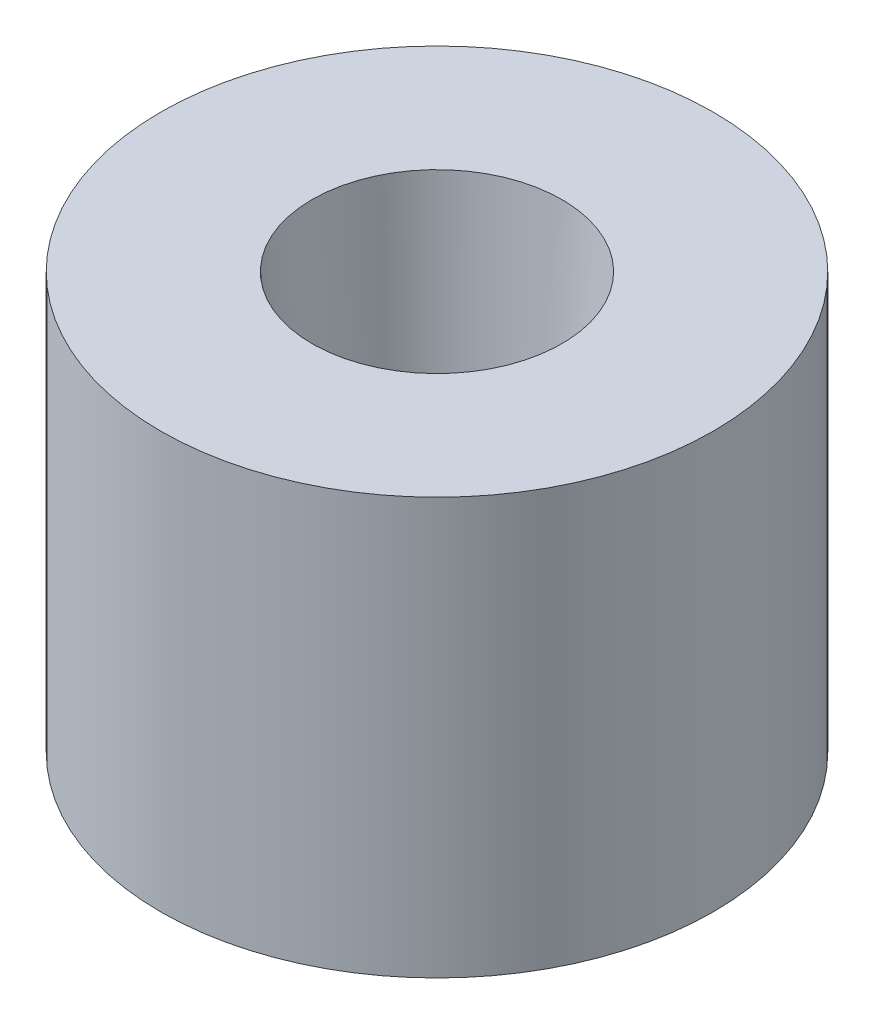
ISO-10303-21;
HEADER;
FILE_DESCRIPTION(('STEP AP214'),'2;1');
FILE_NAME('part.step','',(''),(''),'','','');
FILE_SCHEMA(('AUTOMOTIVE_DESIGN { 1 0 10303 214 1 1 1 1 }'));
ENDSEC;
DATA;
#1=APPLICATION_CONTEXT('core data for automotive mechanical design processes');
#2=APPLICATION_PROTOCOL_DEFINITION('international standard','automotive_design',2000,#1);
#3=PRODUCT_CONTEXT('',#1,'mechanical');
#4=PRODUCT('Part','Part','',(#3));
#5=PRODUCT_RELATED_PRODUCT_CATEGORY('part','',(#4));
#6=PRODUCT_DEFINITION_FORMATION('','',#4);
#7=PRODUCT_DEFINITION_CONTEXT('part definition',#1,'design');
#8=PRODUCT_DEFINITION('design','',#6,#7);
#9=PRODUCT_DEFINITION_SHAPE('','',#8);
#10=(LENGTH_UNIT() NAMED_UNIT(*) SI_UNIT(.MILLI.,.METRE.));
#11=(NAMED_UNIT(*) PLANE_ANGLE_UNIT() SI_UNIT($,.RADIAN.));
#12=(NAMED_UNIT(*) SI_UNIT($,.STERADIAN.) SOLID_ANGLE_UNIT());
#13=UNCERTAINTY_MEASURE_WITH_UNIT(LENGTH_MEASURE(1.E-05),#10,'distance_accuracy_value','');
#14=(GEOMETRIC_REPRESENTATION_CONTEXT(3) GLOBAL_UNCERTAINTY_ASSIGNED_CONTEXT((#13)) GLOBAL_UNIT_ASSIGNED_CONTEXT((#10,
#11,#12)) REPRESENTATION_CONTEXT('',''));
#15=CARTESIAN_POINT('',(0.,0.,0.));
#16=DIRECTION('',(0.,0.,1.));
#17=DIRECTION('',(1.,0.,0.));
#18=AXIS2_PLACEMENT_3D('',#15,#16,#17);
#19=CARTESIAN_POINT('',(0.,0.,0.));
#20=DIRECTION('',(0.,-1.,0.));
#21=DIRECTION('',(1.,0.,0.));
#22=AXIS2_PLACEMENT_3D('',#19,#20,#21);
#23=PLANE('',#22);
#24=CARTESIAN_POINT('',(0.,0.,0.));
#25=DIRECTION('',(0.,1.,0.));
#26=DIRECTION('',(-1.,0.,0.));
#27=AXIS2_PLACEMENT_3D('',#24,#25,#26);
#28=CIRCLE('',#27,3.65);
#29=CARTESIAN_POINT('',(-3.65,0.,0.));
#30=VERTEX_POINT('',#29);
#31=EDGE_CURVE('E10',#30,#30,#28,.T.);
#32=ORIENTED_EDGE('',*,*,#31,.F.);
#33=EDGE_LOOP('',(#32));
#34=FACE_BOUND('',#33,.T.);
#35=ADVANCED_FACE('F34',(#34),#23,.T.);
#36=CARTESIAN_POINT('',(0.,1.5,0.));
#37=DIRECTION('',(0.,1.,0.));
#38=DIRECTION('',(-1.,0.,0.));
#39=AXIS2_PLACEMENT_3D('',#36,#37,#38);
#40=CYLINDRICAL_SURFACE('',#39,3.65);
#41=ORIENTED_EDGE('',*,*,#31,.T.);
#42=EDGE_LOOP('',(#41));
#43=FACE_BOUND('',#42,.T.);
#44=CARTESIAN_POINT('',(0.,5.5,0.));
#45=DIRECTION('',(0.,1.,0.));
#46=DIRECTION('',(-1.,0.,0.));
#47=AXIS2_PLACEMENT_3D('',#44,#45,#46);
#48=CIRCLE('',#47,3.65);
#49=CARTESIAN_POINT('',(-3.65,5.5,0.));
#50=VERTEX_POINT('',#49);
#51=EDGE_CURVE('E41',#50,#50,#48,.T.);
#52=ORIENTED_EDGE('',*,*,#51,.F.);
#53=EDGE_LOOP('',(#52));
#54=FACE_BOUND('',#53,.T.);
#55=ADVANCED_FACE('F73',(#43,#54),#40,.T.);
#56=CARTESIAN_POINT('',(-3.65,5.5,0.));
#57=DIRECTION('',(0.,1.,0.));
#58=DIRECTION('',(-1.,0.,0.));
#59=AXIS2_PLACEMENT_3D('',#56,#57,#58);
#60=PLANE('',#59);
#61=ORIENTED_EDGE('',*,*,#51,.T.);
#62=EDGE_LOOP('',(#61));
#63=FACE_BOUND('',#62,.T.);
#64=CARTESIAN_POINT('',(0.,5.5,0.));
#65=DIRECTION('',(0.,1.,0.));
#66=DIRECTION('',(-1.,0.,0.));
#67=AXIS2_PLACEMENT_3D('',#64,#65,#66);
#68=CIRCLE('',#67,1.65);
#69=CARTESIAN_POINT('',(-1.65,5.5,0.));
#70=VERTEX_POINT('',#69);
#71=EDGE_CURVE('E47',#70,#70,#68,.T.);
#72=ORIENTED_EDGE('',*,*,#71,.F.);
#73=EDGE_LOOP('',(#72));
#74=FACE_BOUND('',#73,.T.);
#75=ADVANCED_FACE('F65',(#63,#74),#60,.T.);
#76=CARTESIAN_POINT('',(0.,1.5,0.));
#77=DIRECTION('',(0.,1.,0.));
#78=DIRECTION('',(-1.,0.,0.));
#79=AXIS2_PLACEMENT_3D('',#76,#77,#78);
#80=CONICAL_SURFACE('',#79,1.43,0.0549446421065616);
#81=ORIENTED_EDGE('',*,*,#71,.T.);
#82=EDGE_LOOP('',(#81));
#83=FACE_BOUND('',#82,.T.);
#84=CARTESIAN_POINT('',(0.,1.5,0.));
#85=DIRECTION('',(0.,1.,0.));
#86=DIRECTION('',(-1.,0.,0.));
#87=AXIS2_PLACEMENT_3D('',#84,#85,#86);
#88=CIRCLE('',#87,1.43);
#89=CARTESIAN_POINT('',(-1.43,1.5,0.));
#90=VERTEX_POINT('',#89);
#91=EDGE_CURVE('E53',#90,#90,#88,.T.);
#92=ORIENTED_EDGE('',*,*,#91,.F.);
#93=EDGE_LOOP('',(#92));
#94=FACE_BOUND('',#93,.T.);
#95=ADVANCED_FACE('F63',(#83,#94),#80,.F.);
#96=CARTESIAN_POINT('',(-1.43,1.5,0.));
#97=DIRECTION('',(0.,1.,0.));
#98=DIRECTION('',(-1.,0.,0.));
#99=AXIS2_PLACEMENT_3D('',#96,#97,#98);
#100=PLANE('',#99);
#101=ORIENTED_EDGE('',*,*,#91,.T.);
#102=EDGE_LOOP('',(#101));
#103=FACE_BOUND('',#102,.T.);
#104=ADVANCED_FACE('F61',(#103),#100,.T.);
#105=CLOSED_SHELL('',(#35,#55,#75,#95,#104));
#106=MANIFOLD_SOLID_BREP('B2',#105);
#107=ADVANCED_BREP_SHAPE_REPRESENTATION('',(#18,#106),#14);
#108=SHAPE_DEFINITION_REPRESENTATION(#9,#107);
ENDSEC;
END-ISO-10303-21;
